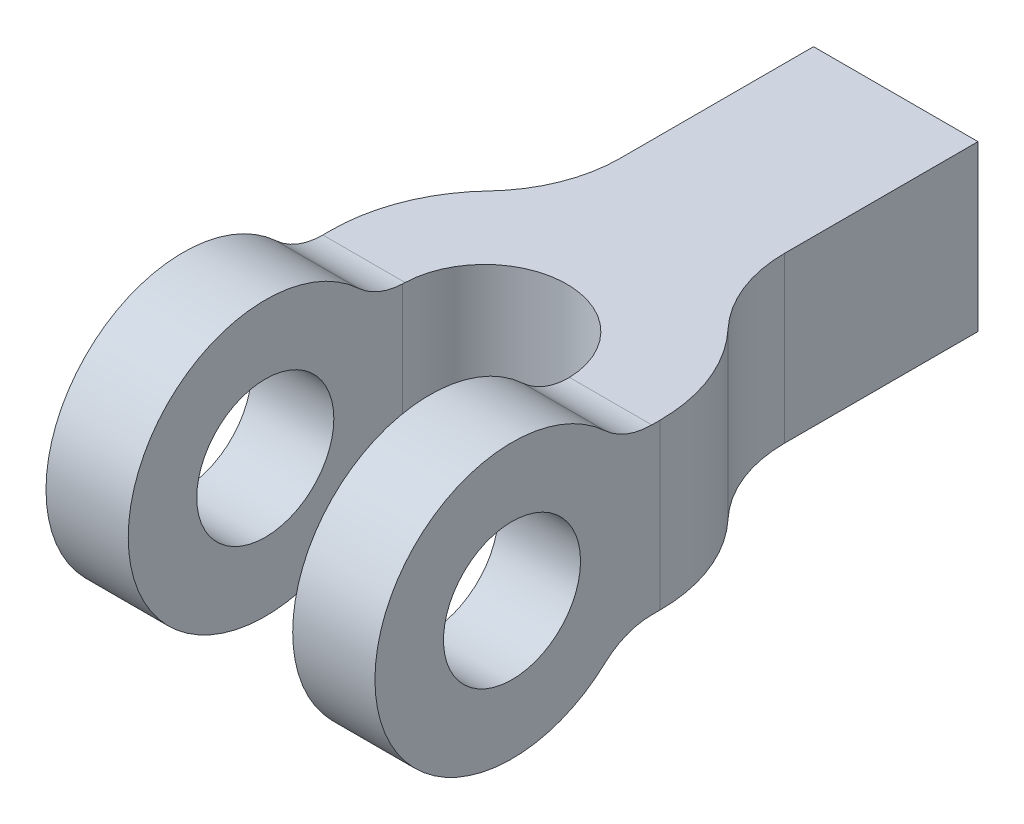
ISO-10303-21;
HEADER;
FILE_DESCRIPTION(('STEP AP214'),'2;1');
FILE_NAME('part.step','',(''),(''),'','','');
FILE_SCHEMA(('AUTOMOTIVE_DESIGN { 1 0 10303 214 1 1 1 1 }'));
ENDSEC;
DATA;
#1=APPLICATION_CONTEXT('core data for automotive mechanical design processes');
#2=APPLICATION_PROTOCOL_DEFINITION('international standard','automotive_design',2000,#1);
#3=PRODUCT_CONTEXT('',#1,'mechanical');
#4=PRODUCT('Part','Part','',(#3));
#5=PRODUCT_RELATED_PRODUCT_CATEGORY('part','',(#4));
#6=PRODUCT_DEFINITION_FORMATION('','',#4);
#7=PRODUCT_DEFINITION_CONTEXT('part definition',#1,'design');
#8=PRODUCT_DEFINITION('design','',#6,#7);
#9=PRODUCT_DEFINITION_SHAPE('','',#8);
#10=(LENGTH_UNIT() NAMED_UNIT(*) SI_UNIT(.MILLI.,.METRE.));
#11=(NAMED_UNIT(*) PLANE_ANGLE_UNIT() SI_UNIT($,.RADIAN.));
#12=(NAMED_UNIT(*) SI_UNIT($,.STERADIAN.) SOLID_ANGLE_UNIT());
#13=UNCERTAINTY_MEASURE_WITH_UNIT(LENGTH_MEASURE(1.E-05),#10,'distance_accuracy_value','');
#14=(GEOMETRIC_REPRESENTATION_CONTEXT(3) GLOBAL_UNCERTAINTY_ASSIGNED_CONTEXT((#13)) GLOBAL_UNIT_ASSIGNED_CONTEXT((#10,
#11,#12)) REPRESENTATION_CONTEXT('',''));
#15=CARTESIAN_POINT('',(0.,0.,0.));
#16=DIRECTION('',(0.,0.,1.));
#17=DIRECTION('',(1.,0.,0.));
#18=AXIS2_PLACEMENT_3D('',#15,#16,#17);
#19=CARTESIAN_POINT('',(-1200.,1000.,0.));
#20=DIRECTION('',(1.,0.,0.));
#21=DIRECTION('',(0.,0.,-1.));
#22=AXIS2_PLACEMENT_3D('',#19,#20,#21);
#23=PLANE('',#22);
#24=CARTESIAN_POINT('',(-1200.,500.,-500.));
#25=DIRECTION('',(1.,0.,0.));
#26=DIRECTION('',(0.,0.,-1.));
#27=AXIS2_PLACEMENT_3D('',#24,#25,#26);
#28=CIRCLE('',#27,250.);
#29=CARTESIAN_POINT('',(-1200.,500.,-750.));
#30=VERTEX_POINT('',#29);
#31=EDGE_CURVE('E309',#30,#30,#28,.T.);
#32=ORIENTED_EDGE('',*,*,#31,.T.);
#33=EDGE_LOOP('',(#32));
#34=FACE_BOUND('',#33,.T.);
#35=CARTESIAN_POINT('',(-1200.,500.,-500.));
#36=DIRECTION('',(1.,0.,0.));
#37=DIRECTION('',(0.,0.,-1.));
#38=AXIS2_PLACEMENT_3D('',#35,#36,#37);
#39=CIRCLE('',#38,500.);
#40=CARTESIAN_POINT('',(-1200.,866.666666666667,-839.934634239519));
#41=VERTEX_POINT('',#40);
#42=CARTESIAN_POINT('',(-1200.,133.333333333333,-839.934634239519));
#43=VERTEX_POINT('',#42);
#44=EDGE_CURVE('E238',#41,#43,#39,.T.);
#45=ORIENTED_EDGE('',*,*,#44,.F.);
#46=CARTESIAN_POINT('',(-1200.,1050.,-1009.90195135928));
#47=DIRECTION('',(1.,0.,0.));
#48=DIRECTION('',(0.,0.,-1.));
#49=AXIS2_PLACEMENT_3D('',#46,#47,#48);
#50=CIRCLE('',#49,250.);
#51=CARTESIAN_POINT('',(-1200.,800.,-1009.90195135928));
#52=VERTEX_POINT('',#51);
#53=EDGE_CURVE('E242',#41,#52,#50,.T.);
#54=ORIENTED_EDGE('',*,*,#53,.T.);
#55=DIRECTION('',(0.,0.,1.));
#56=VECTOR('',#55,1.);
#57=CARTESIAN_POINT('',(-1200.,800.,1.19210735227837E-13));
#58=LINE('',#57,#56);
#59=CARTESIAN_POINT('',(-1200.,800.,-1040.));
#60=VERTEX_POINT('',#59);
#61=EDGE_CURVE('E265',#60,#52,#58,.T.);
#62=ORIENTED_EDGE('',*,*,#61,.F.);
#63=DIRECTION('',(0.,1.,0.));
#64=VECTOR('',#63,1.);
#65=CARTESIAN_POINT('',(-1200.,0.,-1040.));
#66=LINE('',#65,#64);
#67=CARTESIAN_POINT('',(-1200.,200.,-1040.));
#68=VERTEX_POINT('',#67);
#69=EDGE_CURVE('E431',#68,#60,#66,.T.);
#70=ORIENTED_EDGE('',*,*,#69,.F.);
#71=DIRECTION('',(0.,0.,1.));
#72=VECTOR('',#71,1.);
#73=CARTESIAN_POINT('',(-1200.,200.,0.));
#74=LINE('',#73,#72);
#75=CARTESIAN_POINT('',(-1200.,200.,-1009.90195135928));
#76=VERTEX_POINT('',#75);
#77=EDGE_CURVE('E301',#68,#76,#74,.T.);
#78=ORIENTED_EDGE('',*,*,#77,.T.);
#79=CARTESIAN_POINT('',(-1200.,-49.9999999999999,-1009.90195135928));
#80=DIRECTION('',(1.,0.,0.));
#81=DIRECTION('',(0.,0.,-1.));
#82=AXIS2_PLACEMENT_3D('',#79,#80,#81);
#83=CIRCLE('',#82,250.);
#84=EDGE_CURVE('E245',#76,#43,#83,.T.);
#85=ORIENTED_EDGE('',*,*,#84,.T.);
#86=EDGE_LOOP('',(#45,#54,#62,#70,#78,#85));
#87=FACE_BOUND('',#86,.T.);
#88=ADVANCED_FACE('F106',(#34,#87),#23,.F.);
#89=CARTESIAN_POINT('',(0.,1000.,0.));
#90=DIRECTION('',(-1.,0.,0.));
#91=DIRECTION('',(0.,0.,1.));
#92=AXIS2_PLACEMENT_3D('',#89,#90,#91);
#93=PLANE('',#92);
#94=CARTESIAN_POINT('',(0.,500.,-500.));
#95=DIRECTION('',(1.,0.,0.));
#96=DIRECTION('',(0.,0.,-1.));
#97=AXIS2_PLACEMENT_3D('',#94,#95,#96);
#98=CIRCLE('',#97,250.);
#99=CARTESIAN_POINT('',(0.,500.,-750.));
#100=VERTEX_POINT('',#99);
#101=EDGE_CURVE('E300',#100,#100,#98,.T.);
#102=ORIENTED_EDGE('',*,*,#101,.F.);
#103=EDGE_LOOP('',(#102));
#104=FACE_BOUND('',#103,.T.);
#105=CARTESIAN_POINT('',(0.,1050.,-1009.90195135928));
#106=DIRECTION('',(1.,0.,0.));
#107=DIRECTION('',(0.,0.,-1.));
#108=AXIS2_PLACEMENT_3D('',#105,#106,#107);
#109=CIRCLE('',#108,250.);
#110=CARTESIAN_POINT('',(0.,866.666666666667,-839.934634239519));
#111=VERTEX_POINT('',#110);
#112=CARTESIAN_POINT('',(0.,800.,-1009.90195135928));
#113=VERTEX_POINT('',#112);
#114=EDGE_CURVE('E270',#111,#113,#109,.T.);
#115=ORIENTED_EDGE('',*,*,#114,.F.);
#116=CARTESIAN_POINT('',(0.,500.,-500.));
#117=DIRECTION('',(1.,0.,0.));
#118=DIRECTION('',(0.,0.,-1.));
#119=AXIS2_PLACEMENT_3D('',#116,#117,#118);
#120=CIRCLE('',#119,500.);
#121=CARTESIAN_POINT('',(0.,133.333333333333,-839.934634239519));
#122=VERTEX_POINT('',#121);
#123=EDGE_CURVE('E303',#111,#122,#120,.T.);
#124=ORIENTED_EDGE('',*,*,#123,.T.);
#125=CARTESIAN_POINT('',(0.,-49.9999999999999,-1009.90195135928));
#126=DIRECTION('',(1.,0.,0.));
#127=DIRECTION('',(0.,0.,-1.));
#128=AXIS2_PLACEMENT_3D('',#125,#126,#127);
#129=CIRCLE('',#128,250.);
#130=CARTESIAN_POINT('',(0.,200.,-1009.90195135928));
#131=VERTEX_POINT('',#130);
#132=EDGE_CURVE('E308',#131,#122,#129,.T.);
#133=ORIENTED_EDGE('',*,*,#132,.F.);
#134=DIRECTION('',(0.,0.,1.));
#135=VECTOR('',#134,1.);
#136=CARTESIAN_POINT('',(0.,200.,0.));
#137=LINE('',#136,#135);
#138=CARTESIAN_POINT('',(0.,200.,-1040.));
#139=VERTEX_POINT('',#138);
#140=EDGE_CURVE('E305',#139,#131,#137,.T.);
#141=ORIENTED_EDGE('',*,*,#140,.F.);
#142=DIRECTION('',(0.,1.,0.));
#143=VECTOR('',#142,1.);
#144=CARTESIAN_POINT('',(0.,0.,-1040.));
#145=LINE('',#144,#143);
#146=CARTESIAN_POINT('',(0.,800.,-1040.));
#147=VERTEX_POINT('',#146);
#148=EDGE_CURVE('E411',#139,#147,#145,.T.);
#149=ORIENTED_EDGE('',*,*,#148,.T.);
#150=DIRECTION('',(0.,0.,1.));
#151=VECTOR('',#150,1.);
#152=CARTESIAN_POINT('',(0.,800.,1.19210735227837E-13));
#153=LINE('',#152,#151);
#154=EDGE_CURVE('E266',#147,#113,#153,.T.);
#155=ORIENTED_EDGE('',*,*,#154,.T.);
#156=EDGE_LOOP('',(#115,#124,#133,#141,#149,#155));
#157=FACE_BOUND('',#156,.T.);
#158=ADVANCED_FACE('F108',(#104,#157),#93,.F.);
#159=CARTESIAN_POINT('',(-900.,0.,0.));
#160=DIRECTION('',(-1.,0.,0.));
#161=DIRECTION('',(0.,0.,1.));
#162=AXIS2_PLACEMENT_3D('',#159,#160,#161);
#163=PLANE('',#162);
#164=CARTESIAN_POINT('',(-900.,500.,-500.));
#165=DIRECTION('',(-1.,0.,0.));
#166=DIRECTION('',(0.,0.,1.));
#167=AXIS2_PLACEMENT_3D('',#164,#165,#166);
#168=CIRCLE('',#167,250.);
#169=CARTESIAN_POINT('',(-900.,500.,-250.));
#170=VERTEX_POINT('',#169);
#171=EDGE_CURVE('E444',#170,#170,#168,.T.);
#172=ORIENTED_EDGE('',*,*,#171,.T.);
#173=EDGE_LOOP('',(#172));
#174=FACE_BOUND('',#173,.T.);
#175=CARTESIAN_POINT('',(-900.,1050.,-1009.90195135928));
#176=DIRECTION('',(-1.,0.,0.));
#177=DIRECTION('',(0.,0.,1.));
#178=AXIS2_PLACEMENT_3D('',#175,#176,#177);
#179=CIRCLE('',#178,250.);
#180=CARTESIAN_POINT('',(-900.,800.196174250116,-1000.));
#181=VERTEX_POINT('',#180);
#182=CARTESIAN_POINT('',(-900.,866.666666666667,-839.934634239519));
#183=VERTEX_POINT('',#182);
#184=EDGE_CURVE('E295',#181,#183,#179,.T.);
#185=ORIENTED_EDGE('',*,*,#184,.T.);
#186=CARTESIAN_POINT('',(-900.,500.,-500.));
#187=DIRECTION('',(-1.,0.,0.));
#188=DIRECTION('',(0.,0.,1.));
#189=AXIS2_PLACEMENT_3D('',#186,#187,#188);
#190=CIRCLE('',#189,500.);
#191=CARTESIAN_POINT('',(-900.,133.333333333333,-839.934634239519));
#192=VERTEX_POINT('',#191);
#193=EDGE_CURVE('E255',#192,#183,#190,.T.);
#194=ORIENTED_EDGE('',*,*,#193,.F.);
#195=CARTESIAN_POINT('',(-900.,-49.9999999999999,-1009.90195135928));
#196=DIRECTION('',(-1.,0.,0.));
#197=DIRECTION('',(0.,0.,1.));
#198=AXIS2_PLACEMENT_3D('',#195,#196,#197);
#199=CIRCLE('',#198,250.);
#200=CARTESIAN_POINT('',(-900.,199.803825749884,-1000.));
#201=VERTEX_POINT('',#200);
#202=EDGE_CURVE('E504',#192,#201,#199,.T.);
#203=ORIENTED_EDGE('',*,*,#202,.T.);
#204=DIRECTION('',(0.,1.,0.));
#205=VECTOR('',#204,1.);
#206=CARTESIAN_POINT('',(-900.,0.,-1000.));
#207=LINE('',#206,#205);
#208=EDGE_CURVE('E426',#201,#181,#207,.T.);
#209=ORIENTED_EDGE('',*,*,#208,.T.);
#210=EDGE_LOOP('',(#185,#194,#203,#209));
#211=FACE_BOUND('',#210,.T.);
#212=ADVANCED_FACE('F369',(#174,#211),#163,.F.);
#213=CARTESIAN_POINT('',(-300.,0.,0.));
#214=DIRECTION('',(-1.,0.,0.));
#215=DIRECTION('',(0.,0.,1.));
#216=AXIS2_PLACEMENT_3D('',#213,#214,#215);
#217=PLANE('',#216);
#218=CARTESIAN_POINT('',(-300.,500.,-500.));
#219=DIRECTION('',(-1.,0.,0.));
#220=DIRECTION('',(0.,0.,1.));
#221=AXIS2_PLACEMENT_3D('',#218,#219,#220);
#222=CIRCLE('',#221,250.);
#223=CARTESIAN_POINT('',(-300.,500.,-250.));
#224=VERTEX_POINT('',#223);
#225=EDGE_CURVE('E441',#224,#224,#222,.T.);
#226=ORIENTED_EDGE('',*,*,#225,.F.);
#227=EDGE_LOOP('',(#226));
#228=FACE_BOUND('',#227,.T.);
#229=CARTESIAN_POINT('',(-300.,500.,-500.));
#230=DIRECTION('',(-1.,0.,0.));
#231=DIRECTION('',(0.,0.,1.));
#232=AXIS2_PLACEMENT_3D('',#229,#230,#231);
#233=CIRCLE('',#232,500.);
#234=CARTESIAN_POINT('',(-300.,133.333333333333,-839.934634239519));
#235=VERTEX_POINT('',#234);
#236=CARTESIAN_POINT('',(-300.,866.666666666667,-839.934634239519));
#237=VERTEX_POINT('',#236);
#238=EDGE_CURVE('E436',#235,#237,#233,.T.);
#239=ORIENTED_EDGE('',*,*,#238,.T.);
#240=CARTESIAN_POINT('',(-300.,1050.,-1009.90195135928));
#241=DIRECTION('',(-1.,0.,0.));
#242=DIRECTION('',(0.,0.,1.));
#243=AXIS2_PLACEMENT_3D('',#240,#241,#242);
#244=CIRCLE('',#243,250.);
#245=CARTESIAN_POINT('',(-300.,800.196174250116,-1000.));
#246=VERTEX_POINT('',#245);
#247=EDGE_CURVE('E297',#246,#237,#244,.T.);
#248=ORIENTED_EDGE('',*,*,#247,.F.);
#249=DIRECTION('',(0.,1.,0.));
#250=VECTOR('',#249,1.);
#251=CARTESIAN_POINT('',(-300.,0.,-1000.));
#252=LINE('',#251,#250);
#253=CARTESIAN_POINT('',(-300.,199.803825749884,-1000.));
#254=VERTEX_POINT('',#253);
#255=EDGE_CURVE('E419',#254,#246,#252,.T.);
#256=ORIENTED_EDGE('',*,*,#255,.F.);
#257=CARTESIAN_POINT('',(-300.,-49.9999999999999,-1009.90195135928));
#258=DIRECTION('',(-1.,0.,0.));
#259=DIRECTION('',(0.,0.,1.));
#260=AXIS2_PLACEMENT_3D('',#257,#258,#259);
#261=CIRCLE('',#260,250.);
#262=EDGE_CURVE('E438',#235,#254,#261,.T.);
#263=ORIENTED_EDGE('',*,*,#262,.F.);
#264=EDGE_LOOP('',(#239,#248,#256,#263));
#265=FACE_BOUND('',#264,.T.);
#266=ADVANCED_FACE('F371',(#228,#265),#217,.T.);
#267=CARTESIAN_POINT('',(0.,1000.,-2500.));
#268=DIRECTION('',(0.,0.,1.));
#269=DIRECTION('',(1.,0.,0.));
#270=AXIS2_PLACEMENT_3D('',#267,#268,#269);
#271=PLANE('',#270);
#272=DIRECTION('',(1.,0.,0.));
#273=VECTOR('',#272,1.);
#274=CARTESIAN_POINT('',(-1200.,800.,-2500.));
#275=LINE('',#274,#273);
#276=CARTESIAN_POINT('',(-900.,800.,-2500.));
#277=VERTEX_POINT('',#276);
#278=CARTESIAN_POINT('',(-300.,800.,-2500.));
#279=VERTEX_POINT('',#278);
#280=EDGE_CURVE('E275',#277,#279,#275,.T.);
#281=ORIENTED_EDGE('',*,*,#280,.T.);
#282=DIRECTION('',(0.,1.,0.));
#283=VECTOR('',#282,1.);
#284=CARTESIAN_POINT('',(-300.,0.,-2500.));
#285=LINE('',#284,#283);
#286=CARTESIAN_POINT('',(-300.,200.,-2500.));
#287=VERTEX_POINT('',#286);
#288=EDGE_CURVE('E401',#287,#279,#285,.T.);
#289=ORIENTED_EDGE('',*,*,#288,.F.);
#290=DIRECTION('',(1.,0.,0.));
#291=VECTOR('',#290,1.);
#292=CARTESIAN_POINT('',(-1200.,200.,-2500.));
#293=LINE('',#292,#291);
#294=CARTESIAN_POINT('',(-900.,200.,-2500.));
#295=VERTEX_POINT('',#294);
#296=EDGE_CURVE('E314',#295,#287,#293,.T.);
#297=ORIENTED_EDGE('',*,*,#296,.F.);
#298=DIRECTION('',(0.,1.,0.));
#299=VECTOR('',#298,1.);
#300=CARTESIAN_POINT('',(-900.,0.,-2500.));
#301=LINE('',#300,#299);
#302=EDGE_CURVE('E403',#295,#277,#301,.T.);
#303=ORIENTED_EDGE('',*,*,#302,.T.);
#304=EDGE_LOOP('',(#281,#289,#297,#303));
#305=FACE_BOUND('',#304,.T.);
#306=ADVANCED_FACE('F377',(#305),#271,.F.);
#307=CARTESIAN_POINT('',(-1400.,0.,-1794.98344352707));
#308=DIRECTION('',(0.,1.,0.));
#309=DIRECTION('',(0.,0.,1.));
#310=AXIS2_PLACEMENT_3D('',#307,#308,#309);
#311=CYLINDRICAL_SURFACE('',#310,500.);
#312=DIRECTION('',(0.,1.,0.));
#313=VECTOR('',#312,1.);
#314=CARTESIAN_POINT('',(-1036.36363636364,0.,-1451.80915101477));
#315=LINE('',#314,#313);
#316=CARTESIAN_POINT('',(-1036.36363636364,200.,-1451.80915101477));
#317=VERTEX_POINT('',#316);
#318=CARTESIAN_POINT('',(-1036.36363636364,800.,-1451.80915101477));
#319=VERTEX_POINT('',#318);
#320=EDGE_CURVE('E427',#317,#319,#315,.T.);
#321=ORIENTED_EDGE('',*,*,#320,.T.);
#322=CARTESIAN_POINT('',(-1400.,800.,-1794.98344352707));
#323=DIRECTION('',(0.,1.,0.));
#324=DIRECTION('',(0.,0.,1.));
#325=AXIS2_PLACEMENT_3D('',#322,#323,#324);
#326=CIRCLE('',#325,500.);
#327=CARTESIAN_POINT('',(-900.,800.,-1794.98344352707));
#328=VERTEX_POINT('',#327);
#329=EDGE_CURVE('E289',#319,#328,#326,.T.);
#330=ORIENTED_EDGE('',*,*,#329,.T.);
#331=DIRECTION('',(0.,1.,0.));
#332=VECTOR('',#331,1.);
#333=CARTESIAN_POINT('',(-900.,0.,-1794.98344352707));
#334=LINE('',#333,#332);
#335=CARTESIAN_POINT('',(-900.,200.,-1794.98344352707));
#336=VERTEX_POINT('',#335);
#337=EDGE_CURVE('E410',#336,#328,#334,.T.);
#338=ORIENTED_EDGE('',*,*,#337,.F.);
#339=CARTESIAN_POINT('',(-1400.,200.,-1794.98344352707));
#340=DIRECTION('',(0.,1.,0.));
#341=DIRECTION('',(0.,0.,1.));
#342=AXIS2_PLACEMENT_3D('',#339,#340,#341);
#343=CIRCLE('',#342,500.);
#344=EDGE_CURVE('E333',#317,#336,#343,.T.);
#345=ORIENTED_EDGE('',*,*,#344,.F.);
#346=EDGE_LOOP('',(#321,#330,#338,#345));
#347=FACE_BOUND('',#346,.T.);
#348=ADVANCED_FACE('F388',(#347),#311,.F.);
#349=CARTESIAN_POINT('',(-600.,0.,-1040.));
#350=DIRECTION('',(0.,1.,0.));
#351=DIRECTION('',(0.,0.,1.));
#352=AXIS2_PLACEMENT_3D('',#349,#350,#351);
#353=CYLINDRICAL_SURFACE('',#352,600.);
#354=ORIENTED_EDGE('',*,*,#69,.T.);
#355=CARTESIAN_POINT('',(-600.,800.,-1040.));
#356=DIRECTION('',(0.,1.,0.));
#357=DIRECTION('',(0.,0.,1.));
#358=AXIS2_PLACEMENT_3D('',#355,#356,#357);
#359=CIRCLE('',#358,600.);
#360=EDGE_CURVE('E292',#60,#319,#359,.F.);
#361=ORIENTED_EDGE('',*,*,#360,.T.);
#362=ORIENTED_EDGE('',*,*,#320,.F.);
#363=CARTESIAN_POINT('',(-600.,200.,-1040.));
#364=DIRECTION('',(0.,1.,0.));
#365=DIRECTION('',(0.,0.,1.));
#366=AXIS2_PLACEMENT_3D('',#363,#364,#365);
#367=CIRCLE('',#366,600.);
#368=EDGE_CURVE('E335',#68,#317,#367,.F.);
#369=ORIENTED_EDGE('',*,*,#368,.F.);
#370=EDGE_LOOP('',(#354,#361,#362,#369));
#371=FACE_BOUND('',#370,.T.);
#372=ADVANCED_FACE('F395',(#371),#353,.T.);
#373=CARTESIAN_POINT('',(-900.,0.,0.));
#374=DIRECTION('',(-1.,0.,0.));
#375=DIRECTION('',(0.,0.,1.));
#376=AXIS2_PLACEMENT_3D('',#373,#374,#375);
#377=PLANE('',#376);
#378=ORIENTED_EDGE('',*,*,#337,.T.);
#379=DIRECTION('',(0.,0.,-1.));
#380=VECTOR('',#379,1.);
#381=CARTESIAN_POINT('',(-900.,800.,1.19210735227837E-13));
#382=LINE('',#381,#380);
#383=EDGE_CURVE('E286',#328,#277,#382,.T.);
#384=ORIENTED_EDGE('',*,*,#383,.T.);
#385=ORIENTED_EDGE('',*,*,#302,.F.);
#386=DIRECTION('',(0.,0.,-1.));
#387=VECTOR('',#386,1.);
#388=CARTESIAN_POINT('',(-900.,200.,0.));
#389=LINE('',#388,#387);
#390=EDGE_CURVE('E331',#336,#295,#389,.T.);
#391=ORIENTED_EDGE('',*,*,#390,.F.);
#392=EDGE_LOOP('',(#378,#384,#385,#391));
#393=FACE_BOUND('',#392,.T.);
#394=ADVANCED_FACE('F470',(#393),#377,.T.);
#395=CARTESIAN_POINT('',(-300.,0.,0.));
#396=DIRECTION('',(-1.,0.,0.));
#397=DIRECTION('',(0.,0.,1.));
#398=AXIS2_PLACEMENT_3D('',#395,#396,#397);
#399=PLANE('',#398);
#400=DIRECTION('',(0.,0.,-1.));
#401=VECTOR('',#400,1.);
#402=CARTESIAN_POINT('',(-300.,800.,1.19210735227837E-13));
#403=LINE('',#402,#401);
#404=CARTESIAN_POINT('',(-300.,800.,-1794.98344352707));
#405=VERTEX_POINT('',#404);
#406=EDGE_CURVE('E282',#405,#279,#403,.T.);
#407=ORIENTED_EDGE('',*,*,#406,.F.);
#408=DIRECTION('',(0.,1.,0.));
#409=VECTOR('',#408,1.);
#410=CARTESIAN_POINT('',(-300.,0.,-1794.98344352707));
#411=LINE('',#410,#409);
#412=CARTESIAN_POINT('',(-300.,200.,-1794.98344352707));
#413=VERTEX_POINT('',#412);
#414=EDGE_CURVE('E424',#413,#405,#411,.T.);
#415=ORIENTED_EDGE('',*,*,#414,.F.);
#416=DIRECTION('',(0.,0.,-1.));
#417=VECTOR('',#416,1.);
#418=CARTESIAN_POINT('',(-300.,200.,0.));
#419=LINE('',#418,#417);
#420=EDGE_CURVE('E127',#413,#287,#419,.T.);
#421=ORIENTED_EDGE('',*,*,#420,.T.);
#422=ORIENTED_EDGE('',*,*,#288,.T.);
#423=EDGE_LOOP('',(#407,#415,#421,#422));
#424=FACE_BOUND('',#423,.T.);
#425=ADVANCED_FACE('F407',(#424),#399,.F.);
#426=CARTESIAN_POINT('',(-600.,0.,-1040.));
#427=DIRECTION('',(0.,1.,0.));
#428=DIRECTION('',(0.,0.,1.));
#429=AXIS2_PLACEMENT_3D('',#426,#427,#428);
#430=CYLINDRICAL_SURFACE('',#429,600.);
#431=DIRECTION('',(0.,1.,0.));
#432=VECTOR('',#431,1.);
#433=CARTESIAN_POINT('',(-163.636363636363,0.,-1451.80915101477));
#434=LINE('',#433,#432);
#435=CARTESIAN_POINT('',(-163.636363636363,200.,-1451.80915101477));
#436=VERTEX_POINT('',#435);
#437=CARTESIAN_POINT('',(-163.636363636364,800.,-1451.80915101477));
#438=VERTEX_POINT('',#437);
#439=EDGE_CURVE('E416',#436,#438,#434,.T.);
#440=ORIENTED_EDGE('',*,*,#439,.T.);
#441=CARTESIAN_POINT('',(-600.,800.,-1040.));
#442=DIRECTION('',(0.,1.,0.));
#443=DIRECTION('',(0.,0.,1.));
#444=AXIS2_PLACEMENT_3D('',#441,#442,#443);
#445=CIRCLE('',#444,600.);
#446=EDGE_CURVE('E278',#438,#147,#445,.F.);
#447=ORIENTED_EDGE('',*,*,#446,.T.);
#448=ORIENTED_EDGE('',*,*,#148,.F.);
#449=CARTESIAN_POINT('',(-600.,200.,-1040.));
#450=DIRECTION('',(0.,1.,0.));
#451=DIRECTION('',(0.,0.,1.));
#452=AXIS2_PLACEMENT_3D('',#449,#450,#451);
#453=CIRCLE('',#452,600.);
#454=EDGE_CURVE('E316',#436,#139,#453,.F.);
#455=ORIENTED_EDGE('',*,*,#454,.F.);
#456=EDGE_LOOP('',(#440,#447,#448,#455));
#457=FACE_BOUND('',#456,.T.);
#458=ADVANCED_FACE('F476',(#457),#430,.T.);
#459=CARTESIAN_POINT('',(200.,0.,-1794.98344352707));
#460=DIRECTION('',(0.,1.,0.));
#461=DIRECTION('',(0.,0.,1.));
#462=AXIS2_PLACEMENT_3D('',#459,#460,#461);
#463=CYLINDRICAL_SURFACE('',#462,500.);
#464=CARTESIAN_POINT('',(200.,800.,-1794.98344352707));
#465=DIRECTION('',(0.,1.,0.));
#466=DIRECTION('',(0.,0.,1.));
#467=AXIS2_PLACEMENT_3D('',#464,#465,#466);
#468=CIRCLE('',#467,500.);
#469=EDGE_CURVE('E440',#438,#405,#468,.F.);
#470=ORIENTED_EDGE('',*,*,#469,.F.);
#471=ORIENTED_EDGE('',*,*,#439,.F.);
#472=CARTESIAN_POINT('',(200.,200.,-1794.98344352707));
#473=DIRECTION('',(0.,1.,0.));
#474=DIRECTION('',(0.,0.,1.));
#475=AXIS2_PLACEMENT_3D('',#472,#473,#474);
#476=CIRCLE('',#475,500.);
#477=EDGE_CURVE('E430',#436,#413,#476,.F.);
#478=ORIENTED_EDGE('',*,*,#477,.T.);
#479=ORIENTED_EDGE('',*,*,#414,.T.);
#480=EDGE_LOOP('',(#470,#471,#478,#479));
#481=FACE_BOUND('',#480,.T.);
#482=ADVANCED_FACE('F480',(#481),#463,.F.);
#483=CARTESIAN_POINT('',(-600.,0.,-1000.));
#484=DIRECTION('',(0.,1.,0.));
#485=DIRECTION('',(0.,0.,1.));
#486=AXIS2_PLACEMENT_3D('',#483,#484,#485);
#487=CYLINDRICAL_SURFACE('',#486,300.);
#488=ORIENTED_EDGE('',*,*,#255,.T.);
#489=CARTESIAN_POINT('',(-300.,800.196174250116,-1000.));
#490=CARTESIAN_POINT('',(-299.999991164818,800.130777132512,-1001.65012722586));
#491=CARTESIAN_POINT('',(-300.013608324942,800.081730719534,-1003.30035345207));
#492=CARTESIAN_POINT('',(-300.068094635799,800.016339302828,-1006.60100390516));
#493=CARTESIAN_POINT('',(-300.108963786534,799.999994299101,-1008.25142813205));
#494=CARTESIAN_POINT('',(-300.163458932574,800.,-1009.90195135928));
#495=B_SPLINE_CURVE_WITH_KNOTS('',3,(#489,#490,#491,#492,#493,#494),.UNSPECIFIED.,.F.,.F.,(4,2,
4),(0.,4.95303323004806,9.9060664600963),.UNSPECIFIED.);
#496=CARTESIAN_POINT('',(-300.163458932574,800.,-1009.90195135928));
#497=VERTEX_POINT('',#496);
#498=EDGE_CURVE('E12',#246,#497,#495,.T.);
#499=ORIENTED_EDGE('',*,*,#498,.T.);
#500=CARTESIAN_POINT('',(-600.,800.,-1000.));
#501=DIRECTION('',(0.,1.,0.));
#502=DIRECTION('',(0.,0.,1.));
#503=AXIS2_PLACEMENT_3D('',#500,#501,#502);
#504=CIRCLE('',#503,300.);
#505=CARTESIAN_POINT('',(-899.836541067426,800.,-1009.90195135928));
#506=VERTEX_POINT('',#505);
#507=EDGE_CURVE('E284',#506,#497,#504,.F.);
#508=ORIENTED_EDGE('',*,*,#507,.F.);
#509=CARTESIAN_POINT('',(-899.836541067426,800.,-1009.90195135928));
#510=CARTESIAN_POINT('',(-899.891036213466,799.999994299101,-1008.25142813205));
#511=CARTESIAN_POINT('',(-899.9319053642,800.016339302828,-1006.60100390516));
#512=CARTESIAN_POINT('',(-899.986391675058,800.081730719534,-1003.30035345207));
#513=CARTESIAN_POINT('',(-900.000008835181,800.130777132512,-1001.65012722586));
#514=CARTESIAN_POINT('',(-900.,800.196174250116,-1000.));
#515=B_SPLINE_CURVE_WITH_KNOTS('',3,(#509,#510,#511,#512,#513,#514),.UNSPECIFIED.,.F.,.F.,(4,2,
4),(0.,4.95303323004824,9.9060664600963),.UNSPECIFIED.);
#516=EDGE_CURVE('E120',#506,#181,#515,.T.);
#517=ORIENTED_EDGE('',*,*,#516,.T.);
#518=ORIENTED_EDGE('',*,*,#208,.F.);
#519=CARTESIAN_POINT('',(-900.,199.803825749884,-1000.));
#520=CARTESIAN_POINT('',(-900.000002568948,199.862389652566,-1001.47738185453));
#521=CARTESIAN_POINT('',(-899.989085837181,199.907840099479,-1002.95522978878));
#522=CARTESIAN_POINT('',(-899.9453997871,199.972516508955,-1005.91116512289));
#523=CARTESIAN_POINT('',(-899.912630636657,199.991742672971,-1007.38925252082));
#524=CARTESIAN_POINT('',(-899.781531805646,200.010088242546,-1011.82258228352));
#525=CARTESIAN_POINT('',(-899.650410750941,199.969886083798,-1014.77717905166));
#526=CARTESIAN_POINT('',(-899.301232954174,199.78515379904,-1020.67600846382));
#527=CARTESIAN_POINT('',(-899.083229783082,199.640687916961,-1023.62024636859));
#528=CARTESIAN_POINT('',(-898.56119207331,199.24848544584,-1029.49420575075));
#529=CARTESIAN_POINT('',(-898.257157319898,199.000748599038,-1032.4239271919));
#530=CARTESIAN_POINT('',(-897.566999601427,198.405650658047,-1038.24130114477));
#531=CARTESIAN_POINT('',(-897.181499831534,198.059039267933,-1041.12910454823));
#532=CARTESIAN_POINT('',(-896.32887474884,197.267297638894,-1046.87904999136));
#533=CARTESIAN_POINT('',(-895.861748626353,196.822166422697,-1049.74119177619));
#534=CARTESIAN_POINT('',(-894.847995222292,195.835522932568,-1055.43484410461));
#535=CARTESIAN_POINT('',(-894.301361186884,195.294002469934,-1058.26635202402));
#536=CARTESIAN_POINT('',(-893.131122166936,194.117091987306,-1063.89369668571));
#537=CARTESIAN_POINT('',(-892.507517167644,193.481701949321,-1066.68953342115));
#538=CARTESIAN_POINT('',(-891.187620508317,192.121334919211,-1072.23485714629));
#539=CARTESIAN_POINT('',(-890.491496951494,191.396564430249,-1074.9844348947));
#540=CARTESIAN_POINT('',(-889.028396214093,189.859214702131,-1080.43980203554));
#541=CARTESIAN_POINT('',(-888.261419085858,189.046635527844,-1083.14559146031));
#542=CARTESIAN_POINT('',(-886.659820677698,187.336750096052,-1088.50978442044));
#543=CARTESIAN_POINT('',(-885.825202384184,186.43944757886,-1091.16819004151));
#544=CARTESIAN_POINT('',(-884.091595698338,184.563207219436,-1096.43469709877));
#545=CARTESIAN_POINT('',(-883.192607098573,183.584269114132,-1099.04279837282));
#546=CARTESIAN_POINT('',(-881.33227945173,181.546406750427,-1104.20988299258));
#547=CARTESIAN_POINT('',(-880.370849980753,180.487366109063,-1106.76878782203));
#548=CARTESIAN_POINT('',(-878.390312138015,178.293745461455,-1111.83122065848));
#549=CARTESIAN_POINT('',(-877.371204320718,177.159166181348,-1114.33474919749));
#550=CARTESIAN_POINT('',(-875.278684319344,174.817451665156,-1119.28481459414));
#551=CARTESIAN_POINT('',(-874.205267201758,173.610309835537,-1121.73134624454));
#552=CARTESIAN_POINT('',(-872.007678349294,171.126565203229,-1126.56568980804));
#553=CARTESIAN_POINT('',(-870.883504681103,169.849959754295,-1128.95349947905));
#554=CARTESIAN_POINT('',(-868.168556808569,166.751695042541,-1134.53045014042));
#555=CARTESIAN_POINT('',(-866.557330622569,164.901264345913,-1137.6937239443));
#556=CARTESIAN_POINT('',(-863.255374801599,161.083315021197,-1143.90616449917));
#557=CARTESIAN_POINT('',(-861.5646394897,159.115788029796,-1146.95532307435));
#558=CARTESIAN_POINT('',(-858.111783608231,155.069597555038,-1152.93868366294));
#559=CARTESIAN_POINT('',(-856.349643380176,152.990903415193,-1155.87285357541));
#560=CARTESIAN_POINT('',(-852.762842667521,148.728770604564,-1161.62435357818));
#561=CARTESIAN_POINT('',(-850.938183310465,146.545333822545,-1164.44168577365));
#562=CARTESIAN_POINT('',(-847.22959168995,142.072877060843,-1169.96654981616));
#563=CARTESIAN_POINT('',(-845.345513757843,139.783589947141,-1172.67376735814));
#564=CARTESIAN_POINT('',(-841.530966780379,135.10940341406,-1177.9703438126));
#565=CARTESIAN_POINT('',(-839.600497500646,132.724503511593,-1180.55970212945));
#566=CARTESIAN_POINT('',(-835.701638233979,127.863234201387,-1185.62041716791));
#567=CARTESIAN_POINT('',(-833.73325326381,125.386876855484,-1188.0917893522));
#568=CARTESIAN_POINT('',(-829.766606613633,120.345471962315,-1192.91723927258));
#569=CARTESIAN_POINT('',(-827.768344909971,117.780424344826,-1195.27131691579));
#570=CARTESIAN_POINT('',(-823.708050712824,112.508914053744,-1199.91100597211));
#571=CARTESIAN_POINT('',(-821.645562248643,109.80060959308,-1202.19412512263));
#572=CARTESIAN_POINT('',(-817.507725632853,104.295541381976,-1206.6388355629));
#573=CARTESIAN_POINT('',(-815.432377387692,101.498776987399,-1208.80042596742));
#574=CARTESIAN_POINT('',(-811.278434895072,95.8169124168035,-1213.00270664449));
#575=CARTESIAN_POINT('',(-809.199840035325,92.9317929939875,-1215.04337028674));
#576=CARTESIAN_POINT('',(-805.050823472019,87.0736499062437,-1219.00315692412));
#577=CARTESIAN_POINT('',(-802.980401681169,84.1006271830517,-1220.92228122065));
#578=CARTESIAN_POINT('',(-798.86930378026,78.0793462081502,-1224.62997653052));
#579=CARTESIAN_POINT('',(-796.82853484613,75.0314950776904,-1226.41910541915));
#580=CARTESIAN_POINT('',(-792.780612927945,68.8453571126907,-1229.87543977162));
#581=CARTESIAN_POINT('',(-790.773461311685,65.7070666124874,-1231.54264028378));
#582=CARTESIAN_POINT('',(-786.809364528587,59.3385403175457,-1234.75255552268));
#583=CARTESIAN_POINT('',(-784.852398678585,56.1083435969778,-1236.29532211384));
#584=CARTESIAN_POINT('',(-781.006390060808,49.551403628104,-1239.25419865476));
#585=CARTESIAN_POINT('',(-779.117337995967,46.22467370827,-1240.67032598062));
#586=CARTESIAN_POINT('',(-775.440971188011,39.4925956228429,-1243.36314974348));
#587=CARTESIAN_POINT('',(-773.653060806687,36.0879215998574,-1244.64071490288));
#588=CARTESIAN_POINT('',(-770.191413165002,29.1757154708014,-1247.06140805679));
#589=CARTESIAN_POINT('',(-768.51762441738,25.6682307839983,-1248.20459684752));
#590=CARTESIAN_POINT('',(-766.111872741057,20.3204870013074,-1249.81550022167));
#591=CARTESIAN_POINT('',(-765.326098261454,18.5201002886232,-1250.33601442636));
#592=CARTESIAN_POINT('',(-763.79502844101,14.8921391407234,-1251.34045896877));
#593=CARTESIAN_POINT('',(-763.049731117102,13.0645660430285,-1251.8243910992));
#594=CARTESIAN_POINT('',(-761.603311276035,9.38006349133861,-1252.75503977935));
#595=CARTESIAN_POINT('',(-760.902240158711,7.52310290669984,-1253.20171321428));
#596=CARTESIAN_POINT('',(-759.549985039515,3.78187563487779,-1254.05598398313));
#597=CARTESIAN_POINT('',(-758.898809571332,1.89760434196562,-1254.46357463567));
#598=CARTESIAN_POINT('',(-758.275095013903,1.30010546123791E-13,-1254.8509256376));
#599=B_SPLINE_CURVE_WITH_KNOTS('',3,(#519,#520,#521,#522,#523,#524,#525,#526,#527,#528,#529,
#530,#531,#532,#533,#534,#535,#536,#537,#538,#539,#540,#541,#542,#543,#544,#545,#546,#547,#548,
#549,#550,#551,#552,#553,#554,#555,#556,#557,#558,#559,#560,#561,#562,#563,#564,#565,#566,#567,
#568,#569,#570,#571,#572,#573,#574,#575,#576,#577,#578,#579,#580,#581,#582,#583,#584,#585,#586,
#587,#588,#589,#590,#591,#592,#593,#594,#595,#596,#597,#598),.UNSPECIFIED.,.F.,.F.,(4,2,2,2,2,2,
2,2,2,2,2,2,2,2,2,2,2,2,2,2,2,2,2,2,2,2,2,2,2,2,2,2,2,2,2,2,2,2,2,4),(0.,4.43542051075405,
8.87080694905179,17.7407194799358,26.605171318867,35.4696452832355,44.2686149512906,
53.0676719050644,61.8674767355362,70.6672832525491,79.4471268963394,88.2269640539433,
97.0064137858687,105.785891810802,114.57838028744,123.370784255857,132.163988373996,
140.957527707772,152.962922044622,164.9691748684,176.978755894804,188.988120440409,
201.029651325666,213.071243059044,225.111252322613,237.151271119444,249.445303189328,
261.73942480098,274.03624382089,286.332931148802,298.573278143176,310.814121959604,
323.049837104417,335.283870811223,347.436128882707,359.582867541978,365.678665250259,
371.774164041825,377.87662126436,383.980119875756),.UNSPECIFIED.);
#600=CARTESIAN_POINT('',(-899.836541067426,200.,-1009.90195135928));
#601=VERTEX_POINT('',#600);
#602=EDGE_CURVE('E135',#201,#601,#599,.T.);
#603=ORIENTED_EDGE('',*,*,#602,.T.);
#604=CARTESIAN_POINT('',(-600.,200.,-1000.));
#605=DIRECTION('',(0.,1.,0.));
#606=DIRECTION('',(0.,0.,1.));
#607=AXIS2_PLACEMENT_3D('',#604,#605,#606);
#608=CIRCLE('',#607,300.);
#609=CARTESIAN_POINT('',(-300.163458932574,200.,-1009.90195135928));
#610=VERTEX_POINT('',#609);
#611=EDGE_CURVE('E328',#601,#610,#608,.F.);
#612=ORIENTED_EDGE('',*,*,#611,.T.);
#613=CARTESIAN_POINT('',(-441.724904986096,0.,-1254.8509256376));
#614=CARTESIAN_POINT('',(-441.135982967091,1.79176084921564,-1254.48518096562));
#615=CARTESIAN_POINT('',(-440.522569377098,3.57164662311838,-1254.10138767389));
#616=CARTESIAN_POINT('',(-439.25099115311,7.10711778206954,-1253.29887589011));
#617=CARTESIAN_POINT('',(-438.592832918653,8.86270659910712,-1252.88016239055));
#618=CARTESIAN_POINT('',(-437.236386408184,12.3481079085198,-1252.00923634757));
#619=CARTESIAN_POINT('',(-436.538131663781,14.0779404583453,-1251.55705170625));
#620=CARTESIAN_POINT('',(-435.104852972285,17.5133250986882,-1250.61987972463));
#621=CARTESIAN_POINT('',(-434.36982759989,19.2188762447134,-1250.13489111252));
#622=CARTESIAN_POINT('',(-432.12023891189,24.2877771638708,-1248.63552205097));
#623=CARTESIAN_POINT('',(-430.556411922527,27.6154458241505,-1247.57370767852));
#624=CARTESIAN_POINT('',(-427.323050054188,34.1778820070809,-1245.32946482462));
#625=CARTESIAN_POINT('',(-425.653489975509,37.412627113914,-1244.14700754862));
#626=CARTESIAN_POINT('',(-422.233100708488,43.7881502795561,-1241.66792325024));
#627=CARTESIAN_POINT('',(-420.482376695573,46.9290417276085,-1240.37144213137));
#628=CARTESIAN_POINT('',(-416.916562112945,53.1243935099877,-1237.6667053242));
#629=CARTESIAN_POINT('',(-415.101476662229,56.1788606834946,-1236.25845851422));
#630=CARTESIAN_POINT('',(-411.420698244519,62.2081844692127,-1233.33105816048));
#631=CARTESIAN_POINT('',(-409.554952625982,65.1829513314382,-1231.81178621999));
#632=CARTESIAN_POINT('',(-405.788367465227,71.0522230542078,-1228.66539953602));
#633=CARTESIAN_POINT('',(-403.887526452141,73.9467245380041,-1227.03828026516));
#634=CARTESIAN_POINT('',(-399.667409227236,80.2476635759533,-1223.32999923585));
#635=CARTESIAN_POINT('',(-397.342847618904,83.6362660873075,-1221.22450058868));
#636=CARTESIAN_POINT('',(-392.678294509752,90.3016897527532,-1216.85920842016));
#637=CARTESIAN_POINT('',(-390.338302528031,93.5785074031312,-1214.59941006919));
#638=CARTESIAN_POINT('',(-385.659285968347,100.020498668818,-1209.92615457904));
#639=CARTESIAN_POINT('',(-383.320261301986,103.185687444628,-1207.51271843151));
#640=CARTESIAN_POINT('',(-378.657437000006,109.403985464168,-1202.53174649299));
#641=CARTESIAN_POINT('',(-376.333637138859,112.457096371238,-1199.96421299044));
#642=CARTESIAN_POINT('',(-371.713010254462,118.451250628743,-1194.67254033483));
#643=CARTESIAN_POINT('',(-369.416204638801,121.392208705951,-1191.94828581988));
#644=CARTESIAN_POINT('',(-364.864185416542,127.156063129139,-1186.34425298183));
#645=CARTESIAN_POINT('',(-362.608972705142,129.978956935691,-1183.46447131656));
#646=CARTESIAN_POINT('',(-358.153344998707,135.500921148913,-1177.54971658743));
#647=CARTESIAN_POINT('',(-355.952916463394,138.200022293492,-1174.5147824483));
#648=CARTESIAN_POINT('',(-351.618858305449,143.468771979999,-1168.28901419921));
#649=CARTESIAN_POINT('',(-349.485223721116,146.038430146112,-1165.09819171453));
#650=CARTESIAN_POINT('',(-345.84420111517,150.387563155366,-1159.41473143769));
#651=CARTESIAN_POINT('',(-344.318776378738,152.198150920302,-1156.95736500731));
#652=CARTESIAN_POINT('',(-341.316372540015,155.741147716368,-1151.95815738064));
#653=CARTESIAN_POINT('',(-339.839391728584,157.473559506421,-1149.41631917097));
#654=CARTESIAN_POINT('',(-336.939161823307,160.85636551773,-1144.24899709367));
#655=CARTESIAN_POINT('',(-335.515909699482,162.506764365694,-1141.62351795834));
#656=CARTESIAN_POINT('',(-332.728343861651,165.721582336749,-1136.28982488299));
#657=CARTESIAN_POINT('',(-331.364030567196,167.286000847817,-1133.58161035425));
#658=CARTESIAN_POINT('',(-328.701764024462,170.322175305555,-1128.08813159484));
#659=CARTESIAN_POINT('',(-327.403713677415,171.794067613958,-1125.30298989224));
#660=CARTESIAN_POINT('',(-324.877228577338,174.643131690266,-1119.65380993719));
#661=CARTESIAN_POINT('',(-323.648792316497,176.020305509871,-1116.78977339556));
#662=CARTESIAN_POINT('',(-321.267117762907,178.675018646257,-1110.98567110495));
#663=CARTESIAN_POINT('',(-320.113870793395,179.952569462773,-1108.04561418353));
#664=CARTESIAN_POINT('',(-317.887906044694,182.40326212235,-1102.09242892846));
#665=CARTESIAN_POINT('',(-316.815185164483,183.576407986321,-1099.07930341457));
#666=CARTESIAN_POINT('',(-314.917212235087,185.637850338118,-1093.46208492847));
#667=CARTESIAN_POINT('',(-314.079537859508,186.54196178589,-1090.86797690994));
#668=CARTESIAN_POINT('',(-312.468403600899,188.269475663939,-1085.63340143241));
#669=CARTESIAN_POINT('',(-311.694941481338,189.092880905416,-1082.99293559197));
#670=CARTESIAN_POINT('',(-310.215217883502,190.656137858799,-1077.66862220713));
#671=CARTESIAN_POINT('',(-309.508959553516,191.3959856566,-1074.98477263722));
#672=CARTESIAN_POINT('',(-308.166572288708,192.789289798484,-1069.57737242422));
#673=CARTESIAN_POINT('',(-307.53044321486,193.442746313829,-1066.85382185984));
#674=CARTESIAN_POINT('',(-306.331834393978,194.659792046773,-1061.3747646775));
#675=CARTESIAN_POINT('',(-305.769254298852,195.223503943052,-1058.61930730361));
#676=CARTESIAN_POINT('',(-304.719140607429,196.259745018266,-1053.07701071907));
#677=CARTESIAN_POINT('',(-304.231609113761,196.732271642568,-1050.29017063152));
#678=CARTESIAN_POINT('',(-303.333929702446,197.583810568144,-1044.69092855759));
#679=CARTESIAN_POINT('',(-302.923753266591,197.962857348213,-1041.87853639378));
#680=CARTESIAN_POINT('',(-302.182418459463,198.625784137934,-1036.23249408061));
#681=CARTESIAN_POINT('',(-301.851251010868,198.909675081536,-1033.39884641189));
#682=CARTESIAN_POINT('',(-301.301018229466,199.355194920721,-1028.0249517969));
#683=CARTESIAN_POINT('',(-301.073670826874,199.526773749904,-1025.48637076498));
#684=CARTESIAN_POINT('',(-300.683596968322,199.792425363593,-1020.400810065));
#685=CARTESIAN_POINT('',(-300.520855100871,199.886516638328,-1017.85383254625));
#686=CARTESIAN_POINT('',(-300.260465144016,199.996697374252,-1012.75619579612));
#687=CARTESIAN_POINT('',(-300.162781398794,200.012829592137,-1010.2055393505));
#688=CARTESIAN_POINT('',(-300.065103547081,199.97842895807,-1006.37866584734));
#689=CARTESIAN_POINT('',(-300.040685560508,199.957188157066,-1005.10270563762));
#690=CARTESIAN_POINT('',(-300.008133020152,199.895163870782,-1002.55104596136));
#691=CARTESIAN_POINT('',(-299.999998549815,199.854380285357,-1001.27534649618));
#692=CARTESIAN_POINT('',(-300.,199.803825749884,-1000.));
#693=B_SPLINE_CURVE_WITH_KNOTS('',3,(#613,#614,#615,#616,#617,#618,#619,#620,#621,#622,#623,
#624,#625,#626,#627,#628,#629,#630,#631,#632,#633,#634,#635,#636,#637,#638,#639,#640,#641,#642,
#643,#644,#645,#646,#647,#648,#649,#650,#651,#652,#653,#654,#655,#656,#657,#658,#659,#660,#661,
#662,#663,#664,#665,#666,#667,#668,#669,#670,#671,#672,#673,#674,#675,#676,#677,#678,#679,#680,
#681,#682,#683,#684,#685,#686,#687,#688,#689,#690,#691,#692),.UNSPECIFIED.,.F.,.F.,(4,2,2,2,2,2,
2,2,2,2,2,2,2,2,2,2,2,2,2,2,2,2,2,2,2,2,2,2,2,2,2,2,2,2,2,2,2,2,2,4),(0.,5.76312512799718,
11.525427720453,17.282979717398,23.0407550616667,34.5163946448749,45.994779622171,
57.4586849474812,68.9216805255208,80.3970837738334,91.8729690598037,105.720667900693,
119.568800377003,133.415044815698,147.261083680045,161.117448332403,174.974110866165,
188.827313933089,202.679485478933,212.91430028849,223.148753616244,233.382628916743,
243.61657705423,253.835070964926,264.053343462826,274.270434688356,284.487132256322,
293.101092613914,301.714752818937,310.328816348786,318.942862801846,327.545031040937,
336.147440242188,344.746671798154,353.344914914183,361.006479357223,368.666215052989,
376.321749284532,380.150641888343,383.979554113356),.UNSPECIFIED.);
#694=EDGE_CURVE('E337',#610,#254,#693,.T.);
#695=ORIENTED_EDGE('',*,*,#694,.T.);
#696=EDGE_LOOP('',(#488,#499,#508,#517,#518,#603,#612,#695));
#697=FACE_BOUND('',#696,.T.);
#698=ADVANCED_FACE('F350',(#697),#487,.F.);
#699=CARTESIAN_POINT('',(-1200.,500.,-500.));
#700=DIRECTION('',(1.,0.,0.));
#701=DIRECTION('',(0.,0.,-1.));
#702=AXIS2_PLACEMENT_3D('',#699,#700,#701);
#703=CYLINDRICAL_SURFACE('',#702,500.);
#704=ORIENTED_EDGE('',*,*,#193,.T.);
#705=DIRECTION('',(1.,0.,0.));
#706=VECTOR('',#705,1.);
#707=CARTESIAN_POINT('',(-1200.,866.666666666667,-839.934634239519));
#708=LINE('',#707,#706);
#709=EDGE_CURVE('E252',#41,#183,#708,.T.);
#710=ORIENTED_EDGE('',*,*,#709,.F.);
#711=ORIENTED_EDGE('',*,*,#44,.T.);
#712=DIRECTION('',(1.,0.,0.));
#713=VECTOR('',#712,1.);
#714=CARTESIAN_POINT('',(-1200.,133.333333333333,-839.934634239519));
#715=LINE('',#714,#713);
#716=EDGE_CURVE('E317',#43,#192,#715,.T.);
#717=ORIENTED_EDGE('',*,*,#716,.T.);
#718=EDGE_LOOP('',(#704,#710,#711,#717));
#719=FACE_BOUND('',#718,.T.);
#720=ADVANCED_FACE('F253',(#719),#703,.T.);
#721=CARTESIAN_POINT('',(-1200.,-49.9999999999999,-1009.90195135928));
#722=DIRECTION('',(1.,0.,0.));
#723=DIRECTION('',(0.,0.,-1.));
#724=AXIS2_PLACEMENT_3D('',#721,#722,#723);
#725=CYLINDRICAL_SURFACE('',#724,250.);
#726=ORIENTED_EDGE('',*,*,#716,.F.);
#727=ORIENTED_EDGE('',*,*,#84,.F.);
#728=DIRECTION('',(1.,0.,0.));
#729=VECTOR('',#728,1.);
#730=CARTESIAN_POINT('',(-1200.,200.,-1009.90195135928));
#731=LINE('',#730,#729);
#732=EDGE_CURVE('E320',#76,#601,#731,.T.);
#733=ORIENTED_EDGE('',*,*,#732,.T.);
#734=ORIENTED_EDGE('',*,*,#602,.F.);
#735=ORIENTED_EDGE('',*,*,#202,.F.);
#736=EDGE_LOOP('',(#726,#727,#733,#734,#735));
#737=FACE_BOUND('',#736,.T.);
#738=ADVANCED_FACE('F354',(#737),#725,.F.);
#739=EDGE_CURVE('E249',#610,#131,#731,.T.);
#740=ORIENTED_EDGE('',*,*,#739,.T.);
#741=ORIENTED_EDGE('',*,*,#132,.T.);
#742=EDGE_CURVE('E319',#235,#122,#715,.T.);
#743=ORIENTED_EDGE('',*,*,#742,.F.);
#744=ORIENTED_EDGE('',*,*,#262,.T.);
#745=ORIENTED_EDGE('',*,*,#694,.F.);
#746=EDGE_LOOP('',(#740,#741,#743,#744,#745));
#747=FACE_BOUND('',#746,.T.);
#748=ADVANCED_FACE('F359',(#747),#725,.F.);
#749=CARTESIAN_POINT('',(-1200.,200.,0.));
#750=DIRECTION('',(0.,1.,0.));
#751=DIRECTION('',(0.,0.,1.));
#752=AXIS2_PLACEMENT_3D('',#749,#750,#751);
#753=PLANE('',#752);
#754=ORIENTED_EDGE('',*,*,#368,.T.);
#755=ORIENTED_EDGE('',*,*,#344,.T.);
#756=ORIENTED_EDGE('',*,*,#390,.T.);
#757=ORIENTED_EDGE('',*,*,#296,.T.);
#758=ORIENTED_EDGE('',*,*,#420,.F.);
#759=ORIENTED_EDGE('',*,*,#477,.F.);
#760=ORIENTED_EDGE('',*,*,#454,.T.);
#761=ORIENTED_EDGE('',*,*,#140,.T.);
#762=ORIENTED_EDGE('',*,*,#739,.F.);
#763=ORIENTED_EDGE('',*,*,#611,.F.);
#764=ORIENTED_EDGE('',*,*,#732,.F.);
#765=ORIENTED_EDGE('',*,*,#77,.F.);
#766=EDGE_LOOP('',(#754,#755,#756,#757,#758,#759,#760,#761,#762,#763,#764,#765));
#767=FACE_BOUND('',#766,.T.);
#768=ADVANCED_FACE('F361',(#767),#753,.F.);
#769=ORIENTED_EDGE('',*,*,#742,.T.);
#770=ORIENTED_EDGE('',*,*,#123,.F.);
#771=EDGE_CURVE('E259',#237,#111,#708,.T.);
#772=ORIENTED_EDGE('',*,*,#771,.F.);
#773=ORIENTED_EDGE('',*,*,#238,.F.);
#774=EDGE_LOOP('',(#769,#770,#772,#773));
#775=FACE_BOUND('',#774,.T.);
#776=ADVANCED_FACE('F360',(#775),#703,.T.);
#777=CARTESIAN_POINT('',(-1200.,500.,-500.));
#778=DIRECTION('',(1.,0.,0.));
#779=DIRECTION('',(0.,0.,-1.));
#780=AXIS2_PLACEMENT_3D('',#777,#778,#779);
#781=CYLINDRICAL_SURFACE('',#780,250.);
#782=ORIENTED_EDGE('',*,*,#225,.T.);
#783=EDGE_LOOP('',(#782));
#784=FACE_BOUND('',#783,.T.);
#785=ORIENTED_EDGE('',*,*,#101,.T.);
#786=EDGE_LOOP('',(#785));
#787=FACE_BOUND('',#786,.T.);
#788=ADVANCED_FACE('F365',(#784,#787),#781,.F.);
#789=ORIENTED_EDGE('',*,*,#31,.F.);
#790=EDGE_LOOP('',(#789));
#791=FACE_BOUND('',#790,.T.);
#792=ORIENTED_EDGE('',*,*,#171,.F.);
#793=EDGE_LOOP('',(#792));
#794=FACE_BOUND('',#793,.T.);
#795=ADVANCED_FACE('F367',(#791,#794),#781,.F.);
#796=CARTESIAN_POINT('',(-1200.,1050.,-1009.90195135928));
#797=DIRECTION('',(1.,0.,0.));
#798=DIRECTION('',(0.,0.,-1.));
#799=AXIS2_PLACEMENT_3D('',#796,#797,#798);
#800=CYLINDRICAL_SURFACE('',#799,250.);
#801=ORIENTED_EDGE('',*,*,#516,.F.);
#802=DIRECTION('',(1.,0.,0.));
#803=VECTOR('',#802,1.);
#804=CARTESIAN_POINT('',(-1200.,800.,-1009.90195135928));
#805=LINE('',#804,#803);
#806=EDGE_CURVE('E264',#52,#506,#805,.T.);
#807=ORIENTED_EDGE('',*,*,#806,.F.);
#808=ORIENTED_EDGE('',*,*,#53,.F.);
#809=ORIENTED_EDGE('',*,*,#709,.T.);
#810=ORIENTED_EDGE('',*,*,#184,.F.);
#811=EDGE_LOOP('',(#801,#807,#808,#809,#810));
#812=FACE_BOUND('',#811,.T.);
#813=ADVANCED_FACE('F262',(#812),#800,.F.);
#814=CARTESIAN_POINT('',(-1200.,800.,1.19210735227837E-13));
#815=DIRECTION('',(0.,1.,0.));
#816=DIRECTION('',(0.,0.,1.));
#817=AXIS2_PLACEMENT_3D('',#814,#815,#816);
#818=PLANE('',#817);
#819=ORIENTED_EDGE('',*,*,#61,.T.);
#820=ORIENTED_EDGE('',*,*,#806,.T.);
#821=ORIENTED_EDGE('',*,*,#507,.T.);
#822=EDGE_CURVE('E258',#497,#113,#805,.T.);
#823=ORIENTED_EDGE('',*,*,#822,.T.);
#824=ORIENTED_EDGE('',*,*,#154,.F.);
#825=ORIENTED_EDGE('',*,*,#446,.F.);
#826=ORIENTED_EDGE('',*,*,#469,.T.);
#827=ORIENTED_EDGE('',*,*,#406,.T.);
#828=ORIENTED_EDGE('',*,*,#280,.F.);
#829=ORIENTED_EDGE('',*,*,#383,.F.);
#830=ORIENTED_EDGE('',*,*,#329,.F.);
#831=ORIENTED_EDGE('',*,*,#360,.F.);
#832=EDGE_LOOP('',(#819,#820,#821,#823,#824,#825,#826,#827,#828,#829,#830,#831));
#833=FACE_BOUND('',#832,.T.);
#834=ADVANCED_FACE('F454',(#833),#818,.T.);
#835=ORIENTED_EDGE('',*,*,#247,.T.);
#836=ORIENTED_EDGE('',*,*,#771,.T.);
#837=ORIENTED_EDGE('',*,*,#114,.T.);
#838=ORIENTED_EDGE('',*,*,#822,.F.);
#839=ORIENTED_EDGE('',*,*,#498,.F.);
#840=EDGE_LOOP('',(#835,#836,#837,#838,#839));
#841=FACE_BOUND('',#840,.T.);
#842=ADVANCED_FACE('F450',(#841),#800,.F.);
#843=CLOSED_SHELL('',(#88,#158,#212,#266,#306,#348,#372,#394,#425,#458,#482,#698,#720,#738,#748,
#768,#776,#788,#795,#813,#834,#842));
#844=MANIFOLD_SOLID_BREP('B2',#843);
#845=ADVANCED_BREP_SHAPE_REPRESENTATION('',(#18,#844),#14);
#846=SHAPE_DEFINITION_REPRESENTATION(#9,#845);
ENDSEC;
END-ISO-10303-21;
